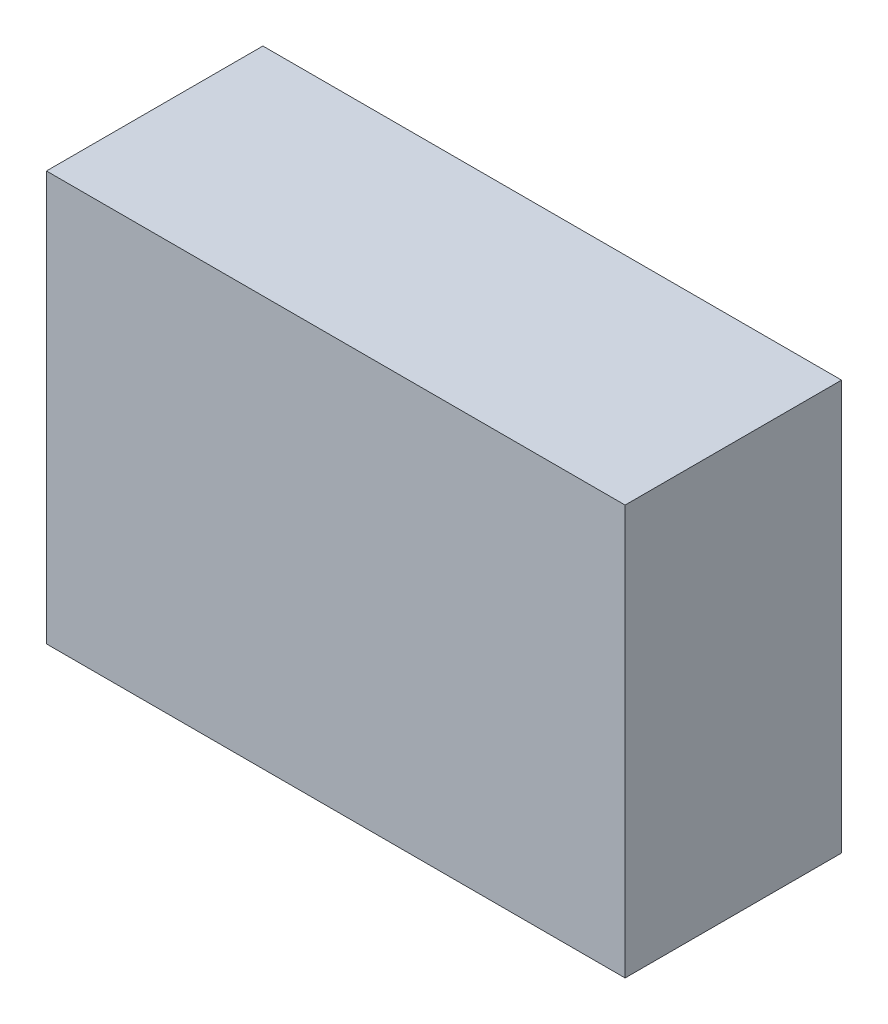
ISO-10303-21;
HEADER;
FILE_DESCRIPTION(('STEP AP214'),'2;1');
FILE_NAME('part.step','',(''),(''),'','','');
FILE_SCHEMA(('AUTOMOTIVE_DESIGN { 1 0 10303 214 1 1 1 1 }'));
ENDSEC;
DATA;
#1=APPLICATION_CONTEXT('core data for automotive mechanical design processes');
#2=APPLICATION_PROTOCOL_DEFINITION('international standard','automotive_design',2000,#1);
#3=PRODUCT_CONTEXT('',#1,'mechanical');
#4=PRODUCT('Part','Part','',(#3));
#5=PRODUCT_RELATED_PRODUCT_CATEGORY('part','',(#4));
#6=PRODUCT_DEFINITION_FORMATION('','',#4);
#7=PRODUCT_DEFINITION_CONTEXT('part definition',#1,'design');
#8=PRODUCT_DEFINITION('design','',#6,#7);
#9=PRODUCT_DEFINITION_SHAPE('','',#8);
#10=(LENGTH_UNIT() NAMED_UNIT(*) SI_UNIT(.MILLI.,.METRE.));
#11=(NAMED_UNIT(*) PLANE_ANGLE_UNIT() SI_UNIT($,.RADIAN.));
#12=(NAMED_UNIT(*) SI_UNIT($,.STERADIAN.) SOLID_ANGLE_UNIT());
#13=UNCERTAINTY_MEASURE_WITH_UNIT(LENGTH_MEASURE(1.E-05),#10,'distance_accuracy_value','');
#14=(GEOMETRIC_REPRESENTATION_CONTEXT(3) GLOBAL_UNCERTAINTY_ASSIGNED_CONTEXT((#13)) GLOBAL_UNIT_ASSIGNED_CONTEXT((#10,
#11,#12)) REPRESENTATION_CONTEXT('',''));
#15=CARTESIAN_POINT('',(0.,0.,0.));
#16=DIRECTION('',(0.,0.,1.));
#17=DIRECTION('',(1.,0.,0.));
#18=AXIS2_PLACEMENT_3D('',#15,#16,#17);
#19=CARTESIAN_POINT('',(0.,0.,288.));
#20=DIRECTION('',(1.,0.,0.));
#21=DIRECTION('',(0.,0.,-1.));
#22=AXIS2_PLACEMENT_3D('',#19,#20,#21);
#23=PLANE('',#22);
#24=DIRECTION('',(0.,-1.,0.));
#25=VECTOR('',#24,1.);
#26=CARTESIAN_POINT('',(0.,0.,0.));
#27=LINE('',#26,#25);
#28=CARTESIAN_POINT('',(0.,545.,0.));
#29=VERTEX_POINT('',#28);
#30=CARTESIAN_POINT('',(0.,0.,0.));
#31=VERTEX_POINT('',#30);
#32=EDGE_CURVE('E107',#29,#31,#27,.T.);
#33=ORIENTED_EDGE('',*,*,#32,.T.);
#34=DIRECTION('',(0.,0.,-1.));
#35=VECTOR('',#34,1.);
#36=CARTESIAN_POINT('',(0.,0.,288.));
#37=LINE('',#36,#35);
#38=CARTESIAN_POINT('',(0.,0.,288.));
#39=VERTEX_POINT('',#38);
#40=EDGE_CURVE('E11',#39,#31,#37,.T.);
#41=ORIENTED_EDGE('',*,*,#40,.F.);
#42=DIRECTION('',(0.,-1.,0.));
#43=VECTOR('',#42,1.);
#44=CARTESIAN_POINT('',(0.,0.,288.));
#45=LINE('',#44,#43);
#46=CARTESIAN_POINT('',(0.,545.,288.));
#47=VERTEX_POINT('',#46);
#48=EDGE_CURVE('E91',#47,#39,#45,.T.);
#49=ORIENTED_EDGE('',*,*,#48,.F.);
#50=DIRECTION('',(0.,0.,-1.));
#51=VECTOR('',#50,1.);
#52=CARTESIAN_POINT('',(0.,545.,288.));
#53=LINE('',#52,#51);
#54=EDGE_CURVE('E103',#47,#29,#53,.T.);
#55=ORIENTED_EDGE('',*,*,#54,.T.);
#56=EDGE_LOOP('',(#33,#41,#49,#55));
#57=FACE_BOUND('',#56,.T.);
#58=ADVANCED_FACE('F39',(#57),#23,.F.);
#59=CARTESIAN_POINT('',(0.,0.,288.));
#60=DIRECTION('',(0.,1.,0.));
#61=DIRECTION('',(0.,0.,1.));
#62=AXIS2_PLACEMENT_3D('',#59,#60,#61);
#63=PLANE('',#62);
#64=DIRECTION('',(1.,0.,0.));
#65=VECTOR('',#64,1.);
#66=CARTESIAN_POINT('',(0.,0.,0.));
#67=LINE('',#66,#65);
#68=CARTESIAN_POINT('',(770.,0.,0.));
#69=VERTEX_POINT('',#68);
#70=EDGE_CURVE('E96',#31,#69,#67,.T.);
#71=ORIENTED_EDGE('',*,*,#70,.T.);
#72=DIRECTION('',(0.,0.,-1.));
#73=VECTOR('',#72,1.);
#74=CARTESIAN_POINT('',(770.,0.,288.));
#75=LINE('',#74,#73);
#76=CARTESIAN_POINT('',(770.,0.,288.));
#77=VERTEX_POINT('',#76);
#78=EDGE_CURVE('E48',#77,#69,#75,.T.);
#79=ORIENTED_EDGE('',*,*,#78,.F.);
#80=DIRECTION('',(1.,0.,0.));
#81=VECTOR('',#80,1.);
#82=CARTESIAN_POINT('',(0.,0.,288.));
#83=LINE('',#82,#81);
#84=EDGE_CURVE('E86',#39,#77,#83,.T.);
#85=ORIENTED_EDGE('',*,*,#84,.F.);
#86=ORIENTED_EDGE('',*,*,#40,.T.);
#87=EDGE_LOOP('',(#71,#79,#85,#86));
#88=FACE_BOUND('',#87,.T.);
#89=ADVANCED_FACE('F95',(#88),#63,.F.);
#90=CARTESIAN_POINT('',(770.,0.,288.));
#91=DIRECTION('',(-1.,0.,0.));
#92=DIRECTION('',(0.,-1.,0.));
#93=AXIS2_PLACEMENT_3D('',#90,#91,#92);
#94=PLANE('',#93);
#95=DIRECTION('',(0.,1.,0.));
#96=VECTOR('',#95,1.);
#97=CARTESIAN_POINT('',(770.,0.,0.));
#98=LINE('',#97,#96);
#99=CARTESIAN_POINT('',(770.,545.,0.));
#100=VERTEX_POINT('',#99);
#101=EDGE_CURVE('E73',#69,#100,#98,.T.);
#102=ORIENTED_EDGE('',*,*,#101,.T.);
#103=DIRECTION('',(0.,0.,-1.));
#104=VECTOR('',#103,1.);
#105=CARTESIAN_POINT('',(770.,545.,288.));
#106=LINE('',#105,#104);
#107=CARTESIAN_POINT('',(770.,545.,288.));
#108=VERTEX_POINT('',#107);
#109=EDGE_CURVE('E98',#108,#100,#106,.T.);
#110=ORIENTED_EDGE('',*,*,#109,.F.);
#111=DIRECTION('',(0.,1.,0.));
#112=VECTOR('',#111,1.);
#113=CARTESIAN_POINT('',(770.,0.,288.));
#114=LINE('',#113,#112);
#115=EDGE_CURVE('E89',#77,#108,#114,.T.);
#116=ORIENTED_EDGE('',*,*,#115,.F.);
#117=ORIENTED_EDGE('',*,*,#78,.T.);
#118=EDGE_LOOP('',(#102,#110,#116,#117));
#119=FACE_BOUND('',#118,.T.);
#120=ADVANCED_FACE('F99',(#119),#94,.F.);
#121=CARTESIAN_POINT('',(0.,545.,288.));
#122=DIRECTION('',(0.,-1.,0.));
#123=DIRECTION('',(0.,0.,-1.));
#124=AXIS2_PLACEMENT_3D('',#121,#122,#123);
#125=PLANE('',#124);
#126=DIRECTION('',(-1.,0.,0.));
#127=VECTOR('',#126,1.);
#128=CARTESIAN_POINT('',(0.,545.,0.));
#129=LINE('',#128,#127);
#130=EDGE_CURVE('E79',#100,#29,#129,.T.);
#131=ORIENTED_EDGE('',*,*,#130,.T.);
#132=ORIENTED_EDGE('',*,*,#54,.F.);
#133=DIRECTION('',(-1.,0.,0.));
#134=VECTOR('',#133,1.);
#135=CARTESIAN_POINT('',(0.,545.,288.));
#136=LINE('',#135,#134);
#137=EDGE_CURVE('E56',#108,#47,#136,.T.);
#138=ORIENTED_EDGE('',*,*,#137,.F.);
#139=ORIENTED_EDGE('',*,*,#109,.T.);
#140=EDGE_LOOP('',(#131,#132,#138,#139));
#141=FACE_BOUND('',#140,.T.);
#142=ADVANCED_FACE('F120',(#141),#125,.F.);
#143=CARTESIAN_POINT('',(0.,0.,288.));
#144=DIRECTION('',(0.,0.,-1.));
#145=DIRECTION('',(-1.,0.,0.));
#146=AXIS2_PLACEMENT_3D('',#143,#144,#145);
#147=PLANE('',#146);
#148=ORIENTED_EDGE('',*,*,#48,.T.);
#149=ORIENTED_EDGE('',*,*,#84,.T.);
#150=ORIENTED_EDGE('',*,*,#115,.T.);
#151=ORIENTED_EDGE('',*,*,#137,.T.);
#152=EDGE_LOOP('',(#148,#149,#150,#151));
#153=FACE_BOUND('',#152,.T.);
#154=ADVANCED_FACE('F87',(#153),#147,.F.);
#155=CARTESIAN_POINT('',(0.,0.,0.));
#156=DIRECTION('',(0.,0.,-1.));
#157=DIRECTION('',(-1.,0.,0.));
#158=AXIS2_PLACEMENT_3D('',#155,#156,#157);
#159=PLANE('',#158);
#160=ORIENTED_EDGE('',*,*,#32,.F.);
#161=ORIENTED_EDGE('',*,*,#130,.F.);
#162=ORIENTED_EDGE('',*,*,#101,.F.);
#163=ORIENTED_EDGE('',*,*,#70,.F.);
#164=EDGE_LOOP('',(#160,#161,#162,#163));
#165=FACE_BOUND('',#164,.T.);
#166=ADVANCED_FACE('F123',(#165),#159,.T.);
#167=CLOSED_SHELL('',(#58,#89,#120,#142,#154,#166));
#168=MANIFOLD_SOLID_BREP('B2',#167);
#169=ADVANCED_BREP_SHAPE_REPRESENTATION('',(#18,#168),#14);
#170=SHAPE_DEFINITION_REPRESENTATION(#9,#169);
ENDSEC;
END-ISO-10303-21;
